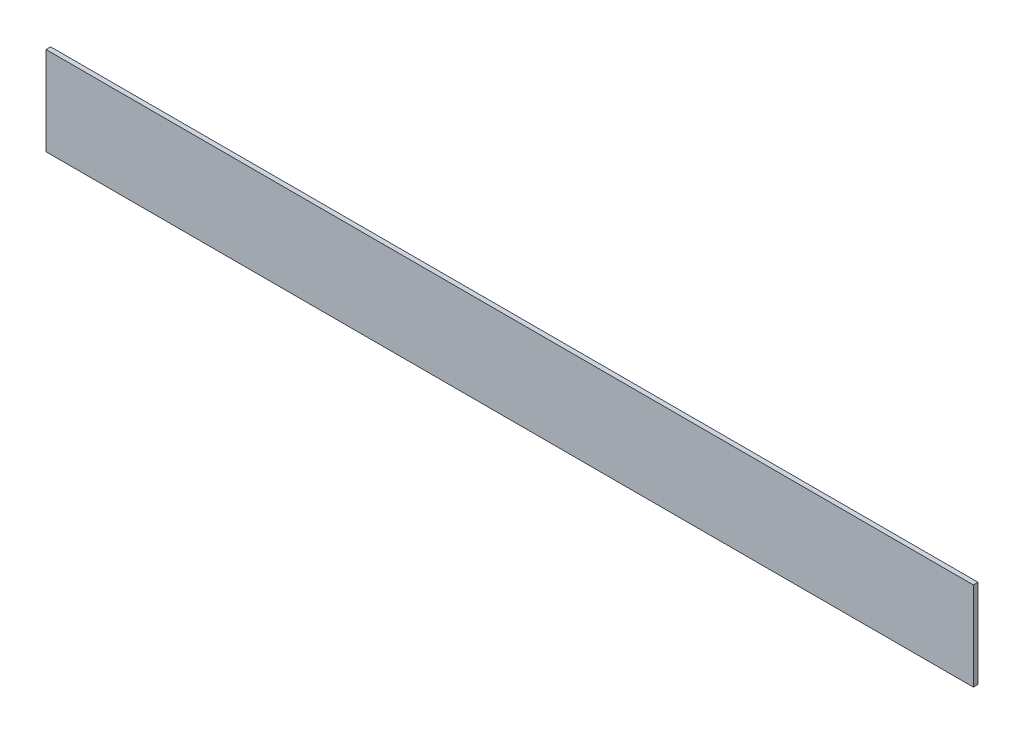
ISO-10303-21;
HEADER;
FILE_DESCRIPTION(('STEP AP214'),'2;1');
FILE_NAME('part.step','',(''),(''),'','','');
FILE_SCHEMA(('AUTOMOTIVE_DESIGN { 1 0 10303 214 1 1 1 1 }'));
ENDSEC;
DATA;
#1=APPLICATION_CONTEXT('core data for automotive mechanical design processes');
#2=APPLICATION_PROTOCOL_DEFINITION('international standard','automotive_design',2000,#1);
#3=PRODUCT_CONTEXT('',#1,'mechanical');
#4=PRODUCT('Part','Part','',(#3));
#5=PRODUCT_RELATED_PRODUCT_CATEGORY('part','',(#4));
#6=PRODUCT_DEFINITION_FORMATION('','',#4);
#7=PRODUCT_DEFINITION_CONTEXT('part definition',#1,'design');
#8=PRODUCT_DEFINITION('design','',#6,#7);
#9=PRODUCT_DEFINITION_SHAPE('','',#8);
#10=(LENGTH_UNIT() NAMED_UNIT(*) SI_UNIT(.MILLI.,.METRE.));
#11=(NAMED_UNIT(*) PLANE_ANGLE_UNIT() SI_UNIT($,.RADIAN.));
#12=(NAMED_UNIT(*) SI_UNIT($,.STERADIAN.) SOLID_ANGLE_UNIT());
#13=UNCERTAINTY_MEASURE_WITH_UNIT(LENGTH_MEASURE(1.E-05),#10,'distance_accuracy_value','');
#14=(GEOMETRIC_REPRESENTATION_CONTEXT(3) GLOBAL_UNCERTAINTY_ASSIGNED_CONTEXT((#13)) GLOBAL_UNIT_ASSIGNED_CONTEXT((#10,
#11,#12)) REPRESENTATION_CONTEXT('',''));
#15=CARTESIAN_POINT('',(0.,0.,0.));
#16=DIRECTION('',(0.,0.,1.));
#17=DIRECTION('',(1.,0.,0.));
#18=AXIS2_PLACEMENT_3D('',#15,#16,#17);
#19=CARTESIAN_POINT('',(0.,0.,-5.));
#20=DIRECTION('',(-1.,0.,0.));
#21=DIRECTION('',(0.,-1.,0.));
#22=AXIS2_PLACEMENT_3D('',#19,#20,#21);
#23=PLANE('',#22);
#24=DIRECTION('',(0.,-1.,0.));
#25=VECTOR('',#24,1.);
#26=CARTESIAN_POINT('',(0.,0.,0.));
#27=LINE('',#26,#25);
#28=CARTESIAN_POINT('',(0.,0.,0.));
#29=VERTEX_POINT('',#28);
#30=CARTESIAN_POINT('',(0.,-95.,0.));
#31=VERTEX_POINT('',#30);
#32=EDGE_CURVE('E104',#29,#31,#27,.T.);
#33=ORIENTED_EDGE('',*,*,#32,.F.);
#34=DIRECTION('',(0.,0.,1.));
#35=VECTOR('',#34,1.);
#36=CARTESIAN_POINT('',(0.,0.,-5.));
#37=LINE('',#36,#35);
#38=CARTESIAN_POINT('',(0.,0.,-5.));
#39=VERTEX_POINT('',#38);
#40=EDGE_CURVE('E11',#39,#29,#37,.T.);
#41=ORIENTED_EDGE('',*,*,#40,.F.);
#42=DIRECTION('',(0.,-1.,0.));
#43=VECTOR('',#42,1.);
#44=CARTESIAN_POINT('',(0.,0.,-5.));
#45=LINE('',#44,#43);
#46=CARTESIAN_POINT('',(0.,-95.,-5.));
#47=VERTEX_POINT('',#46);
#48=EDGE_CURVE('E98',#39,#47,#45,.T.);
#49=ORIENTED_EDGE('',*,*,#48,.T.);
#50=DIRECTION('',(0.,0.,1.));
#51=VECTOR('',#50,1.);
#52=CARTESIAN_POINT('',(0.,-95.,-5.));
#53=LINE('',#52,#51);
#54=EDGE_CURVE('E43',#47,#31,#53,.T.);
#55=ORIENTED_EDGE('',*,*,#54,.T.);
#56=EDGE_LOOP('',(#33,#41,#49,#55));
#57=FACE_BOUND('',#56,.T.);
#58=ADVANCED_FACE('F40',(#57),#23,.T.);
#59=CARTESIAN_POINT('',(0.,0.,-5.));
#60=DIRECTION('',(0.,1.,0.));
#61=DIRECTION('',(0.,0.,1.));
#62=AXIS2_PLACEMENT_3D('',#59,#60,#61);
#63=PLANE('',#62);
#64=DIRECTION('',(-1.,0.,0.));
#65=VECTOR('',#64,1.);
#66=CARTESIAN_POINT('',(0.,0.,0.));
#67=LINE('',#66,#65);
#68=CARTESIAN_POINT('',(995.,0.,0.));
#69=VERTEX_POINT('',#68);
#70=EDGE_CURVE('E100',#69,#29,#67,.T.);
#71=ORIENTED_EDGE('',*,*,#70,.F.);
#72=DIRECTION('',(0.,0.,1.));
#73=VECTOR('',#72,1.);
#74=CARTESIAN_POINT('',(995.,0.,-5.));
#75=LINE('',#74,#73);
#76=CARTESIAN_POINT('',(995.,0.,-5.));
#77=VERTEX_POINT('',#76);
#78=EDGE_CURVE('E49',#77,#69,#75,.T.);
#79=ORIENTED_EDGE('',*,*,#78,.F.);
#80=DIRECTION('',(-1.,0.,0.));
#81=VECTOR('',#80,1.);
#82=CARTESIAN_POINT('',(0.,0.,-5.));
#83=LINE('',#82,#81);
#84=EDGE_CURVE('E95',#77,#39,#83,.T.);
#85=ORIENTED_EDGE('',*,*,#84,.T.);
#86=ORIENTED_EDGE('',*,*,#40,.T.);
#87=EDGE_LOOP('',(#71,#79,#85,#86));
#88=FACE_BOUND('',#87,.T.);
#89=ADVANCED_FACE('F114',(#88),#63,.T.);
#90=CARTESIAN_POINT('',(995.,0.,-5.));
#91=DIRECTION('',(1.,0.,0.));
#92=DIRECTION('',(0.,0.,-1.));
#93=AXIS2_PLACEMENT_3D('',#90,#91,#92);
#94=PLANE('',#93);
#95=DIRECTION('',(0.,1.,0.));
#96=VECTOR('',#95,1.);
#97=CARTESIAN_POINT('',(995.,0.,0.));
#98=LINE('',#97,#96);
#99=CARTESIAN_POINT('',(995.,-95.,0.));
#100=VERTEX_POINT('',#99);
#101=EDGE_CURVE('E90',#100,#69,#98,.T.);
#102=ORIENTED_EDGE('',*,*,#101,.F.);
#103=DIRECTION('',(0.,0.,1.));
#104=VECTOR('',#103,1.);
#105=CARTESIAN_POINT('',(995.,-95.,-5.));
#106=LINE('',#105,#104);
#107=CARTESIAN_POINT('',(995.,-95.,-5.));
#108=VERTEX_POINT('',#107);
#109=EDGE_CURVE('E85',#108,#100,#106,.T.);
#110=ORIENTED_EDGE('',*,*,#109,.F.);
#111=DIRECTION('',(0.,1.,0.));
#112=VECTOR('',#111,1.);
#113=CARTESIAN_POINT('',(995.,0.,-5.));
#114=LINE('',#113,#112);
#115=EDGE_CURVE('E88',#108,#77,#114,.T.);
#116=ORIENTED_EDGE('',*,*,#115,.T.);
#117=ORIENTED_EDGE('',*,*,#78,.T.);
#118=EDGE_LOOP('',(#102,#110,#116,#117));
#119=FACE_BOUND('',#118,.T.);
#120=ADVANCED_FACE('F87',(#119),#94,.T.);
#121=CARTESIAN_POINT('',(0.,-95.,-5.));
#122=DIRECTION('',(0.,-1.,0.));
#123=DIRECTION('',(0.,0.,-1.));
#124=AXIS2_PLACEMENT_3D('',#121,#122,#123);
#125=PLANE('',#124);
#126=DIRECTION('',(1.,0.,0.));
#127=VECTOR('',#126,1.);
#128=CARTESIAN_POINT('',(0.,-95.,0.));
#129=LINE('',#128,#127);
#130=EDGE_CURVE('E107',#31,#100,#129,.T.);
#131=ORIENTED_EDGE('',*,*,#130,.F.);
#132=ORIENTED_EDGE('',*,*,#54,.F.);
#133=DIRECTION('',(1.,0.,0.));
#134=VECTOR('',#133,1.);
#135=CARTESIAN_POINT('',(0.,-95.,-5.));
#136=LINE('',#135,#134);
#137=EDGE_CURVE('E94',#47,#108,#136,.T.);
#138=ORIENTED_EDGE('',*,*,#137,.T.);
#139=ORIENTED_EDGE('',*,*,#109,.T.);
#140=EDGE_LOOP('',(#131,#132,#138,#139));
#141=FACE_BOUND('',#140,.T.);
#142=ADVANCED_FACE('F97',(#141),#125,.T.);
#143=CARTESIAN_POINT('',(0.,0.,-5.));
#144=DIRECTION('',(0.,0.,1.));
#145=DIRECTION('',(1.,0.,0.));
#146=AXIS2_PLACEMENT_3D('',#143,#144,#145);
#147=PLANE('',#146);
#148=ORIENTED_EDGE('',*,*,#48,.F.);
#149=ORIENTED_EDGE('',*,*,#84,.F.);
#150=ORIENTED_EDGE('',*,*,#115,.F.);
#151=ORIENTED_EDGE('',*,*,#137,.F.);
#152=EDGE_LOOP('',(#148,#149,#150,#151));
#153=FACE_BOUND('',#152,.T.);
#154=ADVANCED_FACE('F93',(#153),#147,.F.);
#155=CARTESIAN_POINT('',(0.,0.,0.));
#156=DIRECTION('',(0.,0.,1.));
#157=DIRECTION('',(1.,0.,0.));
#158=AXIS2_PLACEMENT_3D('',#155,#156,#157);
#159=PLANE('',#158);
#160=ORIENTED_EDGE('',*,*,#32,.T.);
#161=ORIENTED_EDGE('',*,*,#130,.T.);
#162=ORIENTED_EDGE('',*,*,#101,.T.);
#163=ORIENTED_EDGE('',*,*,#70,.T.);
#164=EDGE_LOOP('',(#160,#161,#162,#163));
#165=FACE_BOUND('',#164,.T.);
#166=ADVANCED_FACE('F113',(#165),#159,.T.);
#167=CLOSED_SHELL('',(#58,#89,#120,#142,#154,#166));
#168=MANIFOLD_SOLID_BREP('B2',#167);
#169=ADVANCED_BREP_SHAPE_REPRESENTATION('',(#18,#168),#14);
#170=SHAPE_DEFINITION_REPRESENTATION(#9,#169);
ENDSEC;
END-ISO-10303-21;
